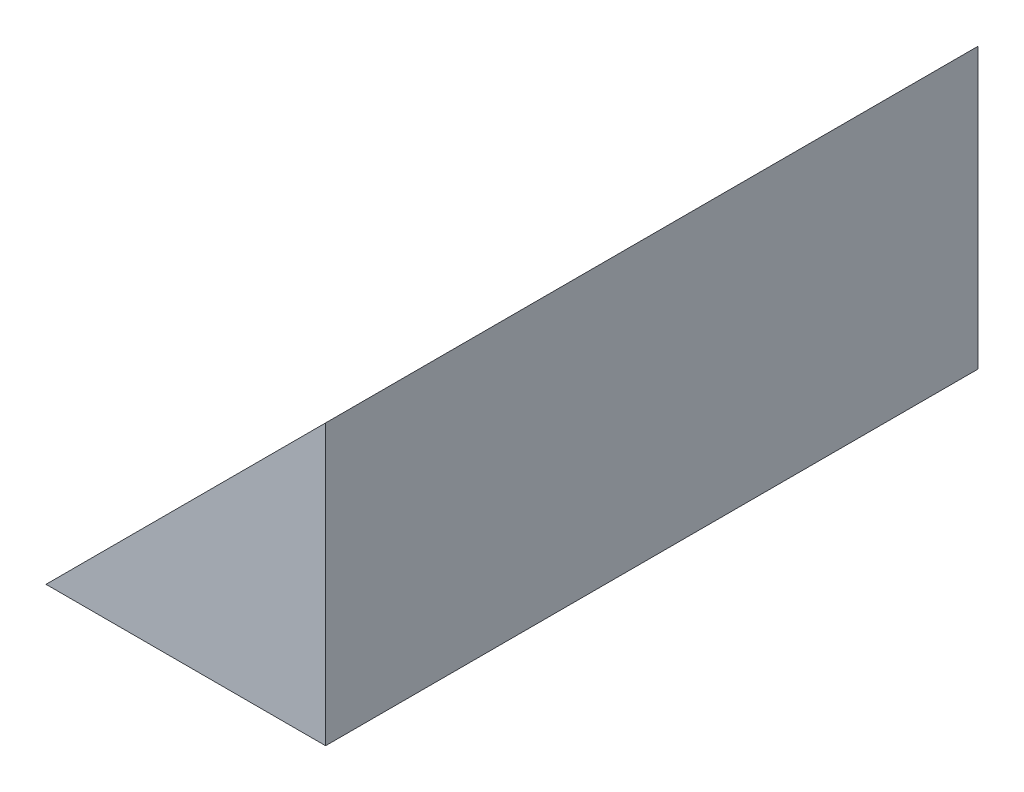
ISO-10303-21;
HEADER;
FILE_DESCRIPTION(('STEP AP214'),'2;1');
FILE_NAME('part.step','',(''),(''),'','','');
FILE_SCHEMA(('AUTOMOTIVE_DESIGN { 1 0 10303 214 1 1 1 1 }'));
ENDSEC;
DATA;
#1=APPLICATION_CONTEXT('core data for automotive mechanical design processes');
#2=APPLICATION_PROTOCOL_DEFINITION('international standard','automotive_design',2000,#1);
#3=PRODUCT_CONTEXT('',#1,'mechanical');
#4=PRODUCT('Part','Part','',(#3));
#5=PRODUCT_RELATED_PRODUCT_CATEGORY('part','',(#4));
#6=PRODUCT_DEFINITION_FORMATION('','',#4);
#7=PRODUCT_DEFINITION_CONTEXT('part definition',#1,'design');
#8=PRODUCT_DEFINITION('design','',#6,#7);
#9=PRODUCT_DEFINITION_SHAPE('','',#8);
#10=(LENGTH_UNIT() NAMED_UNIT(*) SI_UNIT(.MILLI.,.METRE.));
#11=(NAMED_UNIT(*) PLANE_ANGLE_UNIT() SI_UNIT($,.RADIAN.));
#12=(NAMED_UNIT(*) SI_UNIT($,.STERADIAN.) SOLID_ANGLE_UNIT());
#13=UNCERTAINTY_MEASURE_WITH_UNIT(LENGTH_MEASURE(1.E-05),#10,'distance_accuracy_value','');
#14=(GEOMETRIC_REPRESENTATION_CONTEXT(3) GLOBAL_UNCERTAINTY_ASSIGNED_CONTEXT((#13)) GLOBAL_UNIT_ASSIGNED_CONTEXT((#10,
#11,#12)) REPRESENTATION_CONTEXT('',''));
#15=CARTESIAN_POINT('',(0.,0.,0.));
#16=DIRECTION('',(0.,0.,1.));
#17=DIRECTION('',(1.,0.,0.));
#18=AXIS2_PLACEMENT_3D('',#15,#16,#17);
#19=CARTESIAN_POINT('',(0.,38.1,0.));
#20=DIRECTION('',(0.,0.,-1.));
#21=DIRECTION('',(-1.,0.,0.));
#22=AXIS2_PLACEMENT_3D('',#19,#20,#21);
#23=PLANE('',#22);
#24=DIRECTION('',(0.,-1.,0.));
#25=VECTOR('',#24,1.);
#26=CARTESIAN_POINT('',(38.1,38.1,0.));
#27=LINE('',#26,#25);
#28=CARTESIAN_POINT('',(38.1,38.1,0.));
#29=VERTEX_POINT('',#28);
#30=CARTESIAN_POINT('',(38.1,0.,0.));
#31=VERTEX_POINT('',#30);
#32=EDGE_CURVE('E11',#29,#31,#27,.T.);
#33=ORIENTED_EDGE('',*,*,#32,.F.);
#34=DIRECTION('',(0.707106781186547,0.707106781186547,0.));
#35=VECTOR('',#34,1.);
#36=CARTESIAN_POINT('',(0.,0.,0.));
#37=LINE('',#36,#35);
#38=CARTESIAN_POINT('',(0.,0.,0.));
#39=VERTEX_POINT('',#38);
#40=EDGE_CURVE('E75',#39,#29,#37,.T.);
#41=ORIENTED_EDGE('',*,*,#40,.F.);
#42=DIRECTION('',(1.,0.,0.));
#43=VECTOR('',#42,1.);
#44=CARTESIAN_POINT('',(0.,0.,0.));
#45=LINE('',#44,#43);
#46=EDGE_CURVE('E89',#39,#31,#45,.T.);
#47=ORIENTED_EDGE('',*,*,#46,.T.);
#48=EDGE_LOOP('',(#33,#41,#47));
#49=FACE_BOUND('',#48,.T.);
#50=ADVANCED_FACE('F39',(#49),#23,.F.);
#51=CARTESIAN_POINT('',(38.1,38.1,0.));
#52=DIRECTION('',(-1.,0.,0.));
#53=DIRECTION('',(0.,0.,1.));
#54=AXIS2_PLACEMENT_3D('',#51,#52,#53);
#55=PLANE('',#54);
#56=DIRECTION('',(0.,0.,-1.));
#57=VECTOR('',#56,1.);
#58=CARTESIAN_POINT('',(38.1,0.,0.));
#59=LINE('',#58,#57);
#60=CARTESIAN_POINT('',(38.1,0.,-88.9));
#61=VERTEX_POINT('',#60);
#62=EDGE_CURVE('E60',#31,#61,#59,.T.);
#63=ORIENTED_EDGE('',*,*,#62,.T.);
#64=DIRECTION('',(0.,-1.,0.));
#65=VECTOR('',#64,1.);
#66=CARTESIAN_POINT('',(38.1,38.1,-88.9));
#67=LINE('',#66,#65);
#68=CARTESIAN_POINT('',(38.1,38.1,-88.9));
#69=VERTEX_POINT('',#68);
#70=EDGE_CURVE('E46',#69,#61,#67,.T.);
#71=ORIENTED_EDGE('',*,*,#70,.F.);
#72=DIRECTION('',(0.,0.,-1.));
#73=VECTOR('',#72,1.);
#74=CARTESIAN_POINT('',(38.1,38.1,0.));
#75=LINE('',#74,#73);
#76=EDGE_CURVE('E72',#29,#69,#75,.T.);
#77=ORIENTED_EDGE('',*,*,#76,.F.);
#78=ORIENTED_EDGE('',*,*,#32,.T.);
#79=EDGE_LOOP('',(#63,#71,#77,#78));
#80=FACE_BOUND('',#79,.T.);
#81=ADVANCED_FACE('F85',(#80),#55,.F.);
#82=CARTESIAN_POINT('',(0.,38.1,-88.9));
#83=DIRECTION('',(0.,0.,1.));
#84=DIRECTION('',(1.,0.,0.));
#85=AXIS2_PLACEMENT_3D('',#82,#83,#84);
#86=PLANE('',#85);
#87=DIRECTION('',(-1.,0.,0.));
#88=VECTOR('',#87,1.);
#89=CARTESIAN_POINT('',(0.,0.,-88.9));
#90=LINE('',#89,#88);
#91=CARTESIAN_POINT('',(0.,0.,-88.9));
#92=VERTEX_POINT('',#91);
#93=EDGE_CURVE('E77',#61,#92,#90,.T.);
#94=ORIENTED_EDGE('',*,*,#93,.T.);
#95=DIRECTION('',(0.707106781186547,0.707106781186547,0.));
#96=VECTOR('',#95,1.);
#97=CARTESIAN_POINT('',(0.,0.,-88.9));
#98=LINE('',#97,#96);
#99=EDGE_CURVE('E53',#92,#69,#98,.T.);
#100=ORIENTED_EDGE('',*,*,#99,.T.);
#101=ORIENTED_EDGE('',*,*,#70,.T.);
#102=EDGE_LOOP('',(#94,#100,#101));
#103=FACE_BOUND('',#102,.T.);
#104=ADVANCED_FACE('F80',(#103),#86,.F.);
#105=CARTESIAN_POINT('',(0.,0.,0.));
#106=DIRECTION('',(0.,-1.,0.));
#107=DIRECTION('',(0.,0.,-1.));
#108=AXIS2_PLACEMENT_3D('',#105,#106,#107);
#109=PLANE('',#108);
#110=DIRECTION('',(0.,0.,1.));
#111=VECTOR('',#110,1.);
#112=CARTESIAN_POINT('',(0.,0.,0.));
#113=LINE('',#112,#111);
#114=EDGE_CURVE('E83',#92,#39,#113,.T.);
#115=ORIENTED_EDGE('',*,*,#114,.F.);
#116=ORIENTED_EDGE('',*,*,#93,.F.);
#117=ORIENTED_EDGE('',*,*,#62,.F.);
#118=ORIENTED_EDGE('',*,*,#46,.F.);
#119=EDGE_LOOP('',(#115,#116,#117,#118));
#120=FACE_BOUND('',#119,.T.);
#121=ADVANCED_FACE('F95',(#120),#109,.T.);
#122=CARTESIAN_POINT('',(0.,0.,-88.9));
#123=DIRECTION('',(0.707106781186547,-0.707106781186547,0.));
#124=DIRECTION('',(0.707106781186548,0.707106781186548,0.));
#125=AXIS2_PLACEMENT_3D('',#122,#123,#124);
#126=PLANE('',#125);
#127=ORIENTED_EDGE('',*,*,#40,.T.);
#128=ORIENTED_EDGE('',*,*,#76,.T.);
#129=ORIENTED_EDGE('',*,*,#99,.F.);
#130=ORIENTED_EDGE('',*,*,#114,.T.);
#131=EDGE_LOOP('',(#127,#128,#129,#130));
#132=FACE_BOUND('',#131,.T.);
#133=ADVANCED_FACE('F73',(#132),#126,.F.);
#134=CLOSED_SHELL('',(#50,#81,#104,#121,#133));
#135=MANIFOLD_SOLID_BREP('B2',#134);
#136=ADVANCED_BREP_SHAPE_REPRESENTATION('',(#18,#135),#14);
#137=SHAPE_DEFINITION_REPRESENTATION(#9,#136);
ENDSEC;
END-ISO-10303-21;
